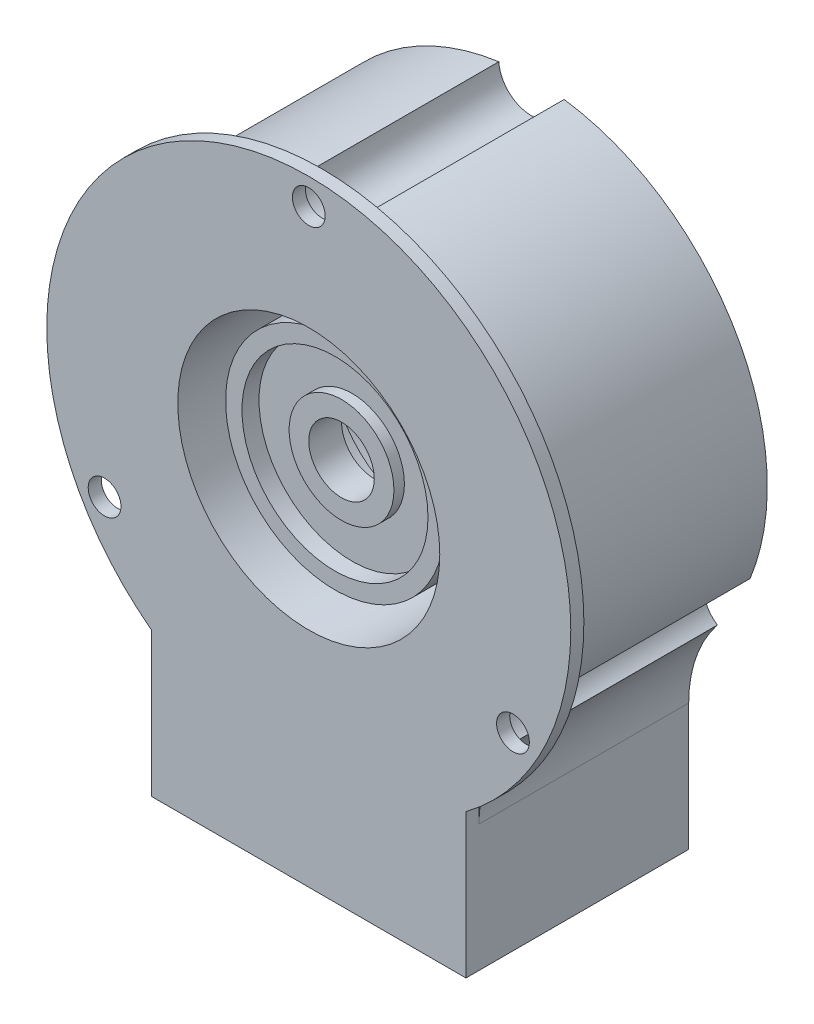
ISO-10303-21;
HEADER;
FILE_DESCRIPTION(('STEP AP214'),'2;1');
FILE_NAME('part.step','',(''),(''),'','','');
FILE_SCHEMA(('AUTOMOTIVE_DESIGN { 1 0 10303 214 1 1 1 1 }'));
ENDSEC;
DATA;
#1=APPLICATION_CONTEXT('core data for automotive mechanical design processes');
#2=APPLICATION_PROTOCOL_DEFINITION('international standard','automotive_design',2000,#1);
#3=PRODUCT_CONTEXT('',#1,'mechanical');
#4=PRODUCT('Part','Part','',(#3));
#5=PRODUCT_RELATED_PRODUCT_CATEGORY('part','',(#4));
#6=PRODUCT_DEFINITION_FORMATION('','',#4);
#7=PRODUCT_DEFINITION_CONTEXT('part definition',#1,'design');
#8=PRODUCT_DEFINITION('design','',#6,#7);
#9=PRODUCT_DEFINITION_SHAPE('','',#8);
#10=(LENGTH_UNIT() NAMED_UNIT(*) SI_UNIT(.MILLI.,.METRE.));
#11=(NAMED_UNIT(*) PLANE_ANGLE_UNIT() SI_UNIT($,.RADIAN.));
#12=(NAMED_UNIT(*) SI_UNIT($,.STERADIAN.) SOLID_ANGLE_UNIT());
#13=UNCERTAINTY_MEASURE_WITH_UNIT(LENGTH_MEASURE(1.E-05),#10,'distance_accuracy_value','');
#14=(GEOMETRIC_REPRESENTATION_CONTEXT(3) GLOBAL_UNCERTAINTY_ASSIGNED_CONTEXT((#13)) GLOBAL_UNIT_ASSIGNED_CONTEXT((#10,
#11,#12)) REPRESENTATION_CONTEXT('',''));
#15=CARTESIAN_POINT('',(0.,0.,0.));
#16=DIRECTION('',(0.,0.,1.));
#17=DIRECTION('',(1.,0.,0.));
#18=AXIS2_PLACEMENT_3D('',#15,#16,#17);
#19=CARTESIAN_POINT('',(0.,27.,16.));
#20=DIRECTION('',(0.,0.,1.));
#21=DIRECTION('',(1.,0.,0.));
#22=AXIS2_PLACEMENT_3D('',#19,#20,#21);
#23=CYLINDRICAL_SURFACE('',#22,7.35);
#24=CARTESIAN_POINT('',(0.,27.,8.));
#25=DIRECTION('',(0.,0.,1.));
#26=DIRECTION('',(1.,0.,0.));
#27=AXIS2_PLACEMENT_3D('',#24,#25,#26);
#28=CIRCLE('',#27,7.35);
#29=CARTESIAN_POINT('',(7.35,27.,8.));
#30=VERTEX_POINT('',#29);
#31=EDGE_CURVE('E11',#30,#30,#28,.T.);
#32=ORIENTED_EDGE('',*,*,#31,.F.);
#33=EDGE_LOOP('',(#32));
#34=FACE_BOUND('',#33,.T.);
#35=CARTESIAN_POINT('',(0.,27.,12.));
#36=DIRECTION('',(0.,0.,1.));
#37=DIRECTION('',(1.,0.,0.));
#38=AXIS2_PLACEMENT_3D('',#35,#36,#37);
#39=CIRCLE('',#38,7.35000000000001);
#40=CARTESIAN_POINT('',(7.35000000000001,27.,12.));
#41=VERTEX_POINT('',#40);
#42=EDGE_CURVE('E91',#41,#41,#39,.T.);
#43=ORIENTED_EDGE('',*,*,#42,.T.);
#44=EDGE_LOOP('',(#43));
#45=FACE_BOUND('',#44,.T.);
#46=ADVANCED_FACE('F51',(#34,#45),#23,.F.);
#47=CARTESIAN_POINT('',(0.,34.35,8.));
#48=DIRECTION('',(0.,0.,1.));
#49=DIRECTION('',(1.,0.,0.));
#50=AXIS2_PLACEMENT_3D('',#47,#48,#49);
#51=PLANE('',#50);
#52=CARTESIAN_POINT('',(0.,27.,8.));
#53=DIRECTION('',(0.,0.,1.));
#54=DIRECTION('',(1.,0.,0.));
#55=AXIS2_PLACEMENT_3D('',#52,#53,#54);
#56=CIRCLE('',#55,8.35);
#57=CARTESIAN_POINT('',(8.35,27.,8.));
#58=VERTEX_POINT('',#57);
#59=EDGE_CURVE('E57',#58,#58,#56,.T.);
#60=ORIENTED_EDGE('',*,*,#59,.F.);
#61=EDGE_LOOP('',(#60));
#62=FACE_BOUND('',#61,.T.);
#63=ORIENTED_EDGE('',*,*,#31,.T.);
#64=EDGE_LOOP('',(#63));
#65=FACE_BOUND('',#64,.T.);
#66=ADVANCED_FACE('F141',(#62,#65),#51,.F.);
#67=CARTESIAN_POINT('',(0.,27.,16.));
#68=DIRECTION('',(0.,0.,1.));
#69=DIRECTION('',(1.,0.,0.));
#70=AXIS2_PLACEMENT_3D('',#67,#68,#69);
#71=CYLINDRICAL_SURFACE('',#70,8.35);
#72=CARTESIAN_POINT('',(0.,27.,15.));
#73=DIRECTION('',(0.,0.,1.));
#74=DIRECTION('',(1.,0.,0.));
#75=AXIS2_PLACEMENT_3D('',#72,#73,#74);
#76=CIRCLE('',#75,8.35);
#77=CARTESIAN_POINT('',(8.35,27.,15.));
#78=VERTEX_POINT('',#77);
#79=EDGE_CURVE('E61',#78,#78,#76,.T.);
#80=ORIENTED_EDGE('',*,*,#79,.F.);
#81=EDGE_LOOP('',(#80));
#82=FACE_BOUND('',#81,.T.);
#83=ORIENTED_EDGE('',*,*,#59,.T.);
#84=EDGE_LOOP('',(#83));
#85=FACE_BOUND('',#84,.T.);
#86=ADVANCED_FACE('F136',(#82,#85),#71,.T.);
#87=CARTESIAN_POINT('',(0.,35.35,15.));
#88=DIRECTION('',(0.,0.,-1.));
#89=DIRECTION('',(-1.,0.,0.));
#90=AXIS2_PLACEMENT_3D('',#87,#88,#89);
#91=PLANE('',#90);
#92=CARTESIAN_POINT('',(0.,27.,15.));
#93=DIRECTION('',(0.,0.,1.));
#94=DIRECTION('',(1.,0.,0.));
#95=AXIS2_PLACEMENT_3D('',#92,#93,#94);
#96=CIRCLE('',#95,7.1);
#97=CARTESIAN_POINT('',(7.1,27.,15.));
#98=VERTEX_POINT('',#97);
#99=EDGE_CURVE('E66',#98,#98,#96,.T.);
#100=ORIENTED_EDGE('',*,*,#99,.F.);
#101=EDGE_LOOP('',(#100));
#102=FACE_BOUND('',#101,.T.);
#103=ORIENTED_EDGE('',*,*,#79,.T.);
#104=EDGE_LOOP('',(#103));
#105=FACE_BOUND('',#104,.T.);
#106=ADVANCED_FACE('F130',(#102,#105),#91,.F.);
#107=CARTESIAN_POINT('',(0.,27.,16.));
#108=DIRECTION('',(0.,0.,1.));
#109=DIRECTION('',(1.,0.,0.));
#110=AXIS2_PLACEMENT_3D('',#107,#108,#109);
#111=CYLINDRICAL_SURFACE('',#110,7.1);
#112=CARTESIAN_POINT('',(0.,27.,13.7));
#113=DIRECTION('',(0.,0.,1.));
#114=DIRECTION('',(1.,0.,0.));
#115=AXIS2_PLACEMENT_3D('',#112,#113,#114);
#116=CIRCLE('',#115,7.1);
#117=CARTESIAN_POINT('',(7.1,27.,13.7));
#118=VERTEX_POINT('',#117);
#119=EDGE_CURVE('E72',#118,#118,#116,.T.);
#120=ORIENTED_EDGE('',*,*,#119,.F.);
#121=EDGE_LOOP('',(#120));
#122=FACE_BOUND('',#121,.T.);
#123=ORIENTED_EDGE('',*,*,#99,.T.);
#124=EDGE_LOOP('',(#123));
#125=FACE_BOUND('',#124,.T.);
#126=ADVANCED_FACE('F124',(#122,#125),#111,.F.);
#127=CARTESIAN_POINT('',(0.,34.1,13.7));
#128=DIRECTION('',(0.,0.,-1.));
#129=DIRECTION('',(-1.,0.,0.));
#130=AXIS2_PLACEMENT_3D('',#127,#128,#129);
#131=PLANE('',#130);
#132=CARTESIAN_POINT('',(0.,27.,13.7));
#133=DIRECTION('',(0.,0.,1.));
#134=DIRECTION('',(1.,0.,0.));
#135=AXIS2_PLACEMENT_3D('',#132,#133,#134);
#136=CIRCLE('',#135,4.);
#137=CARTESIAN_POINT('',(4.,27.,13.7));
#138=VERTEX_POINT('',#137);
#139=EDGE_CURVE('E76',#138,#138,#136,.T.);
#140=ORIENTED_EDGE('',*,*,#139,.F.);
#141=EDGE_LOOP('',(#140));
#142=FACE_BOUND('',#141,.T.);
#143=ORIENTED_EDGE('',*,*,#119,.T.);
#144=EDGE_LOOP('',(#143));
#145=FACE_BOUND('',#144,.T.);
#146=ADVANCED_FACE('F118',(#142,#145),#131,.F.);
#147=CARTESIAN_POINT('',(0.,27.,16.));
#148=DIRECTION('',(0.,0.,1.));
#149=DIRECTION('',(1.,0.,0.));
#150=AXIS2_PLACEMENT_3D('',#147,#148,#149);
#151=CYLINDRICAL_SURFACE('',#150,4.);
#152=CARTESIAN_POINT('',(0.,27.,14.5));
#153=DIRECTION('',(0.,0.,1.));
#154=DIRECTION('',(1.,0.,0.));
#155=AXIS2_PLACEMENT_3D('',#152,#153,#154);
#156=CIRCLE('',#155,4.);
#157=CARTESIAN_POINT('',(4.,27.,14.5));
#158=VERTEX_POINT('',#157);
#159=EDGE_CURVE('E80',#158,#158,#156,.T.);
#160=ORIENTED_EDGE('',*,*,#159,.F.);
#161=EDGE_LOOP('',(#160));
#162=FACE_BOUND('',#161,.T.);
#163=ORIENTED_EDGE('',*,*,#139,.T.);
#164=EDGE_LOOP('',(#163));
#165=FACE_BOUND('',#164,.T.);
#166=ADVANCED_FACE('F112',(#162,#165),#151,.T.);
#167=CARTESIAN_POINT('',(0.,31.,14.5));
#168=DIRECTION('',(0.,0.,-1.));
#169=DIRECTION('',(-1.,0.,0.));
#170=AXIS2_PLACEMENT_3D('',#167,#168,#169);
#171=PLANE('',#170);
#172=CARTESIAN_POINT('',(0.,27.,14.5));
#173=DIRECTION('',(0.,0.,1.));
#174=DIRECTION('',(1.,0.,0.));
#175=AXIS2_PLACEMENT_3D('',#172,#173,#174);
#176=CIRCLE('',#175,2.5);
#177=CARTESIAN_POINT('',(2.5,27.,14.5));
#178=VERTEX_POINT('',#177);
#179=EDGE_CURVE('E84',#178,#178,#176,.T.);
#180=ORIENTED_EDGE('',*,*,#179,.F.);
#181=EDGE_LOOP('',(#180));
#182=FACE_BOUND('',#181,.T.);
#183=ORIENTED_EDGE('',*,*,#159,.T.);
#184=EDGE_LOOP('',(#183));
#185=FACE_BOUND('',#184,.T.);
#186=ADVANCED_FACE('F106',(#182,#185),#171,.F.);
#187=CARTESIAN_POINT('',(0.,27.,16.));
#188=DIRECTION('',(0.,0.,1.));
#189=DIRECTION('',(1.,0.,0.));
#190=AXIS2_PLACEMENT_3D('',#187,#188,#189);
#191=CYLINDRICAL_SURFACE('',#190,2.5);
#192=CARTESIAN_POINT('',(0.,27.,12.));
#193=DIRECTION('',(0.,0.,1.));
#194=DIRECTION('',(1.,0.,0.));
#195=AXIS2_PLACEMENT_3D('',#192,#193,#194);
#196=CIRCLE('',#195,2.5);
#197=CARTESIAN_POINT('',(2.5,27.,12.));
#198=VERTEX_POINT('',#197);
#199=EDGE_CURVE('E88',#198,#198,#196,.T.);
#200=ORIENTED_EDGE('',*,*,#199,.F.);
#201=EDGE_LOOP('',(#200));
#202=FACE_BOUND('',#201,.T.);
#203=ORIENTED_EDGE('',*,*,#179,.T.);
#204=EDGE_LOOP('',(#203));
#205=FACE_BOUND('',#204,.T.);
#206=ADVANCED_FACE('F100',(#202,#205),#191,.F.);
#207=CARTESIAN_POINT('',(0.,29.5,12.));
#208=DIRECTION('',(0.,0.,1.));
#209=DIRECTION('',(1.,0.,0.));
#210=AXIS2_PLACEMENT_3D('',#207,#208,#209);
#211=PLANE('',#210);
#212=ORIENTED_EDGE('',*,*,#42,.F.);
#213=EDGE_LOOP('',(#212));
#214=FACE_BOUND('',#213,.T.);
#215=ORIENTED_EDGE('',*,*,#199,.T.);
#216=EDGE_LOOP('',(#215));
#217=FACE_BOUND('',#216,.T.);
#218=ADVANCED_FACE('F97',(#214,#217),#211,.F.);
#219=CLOSED_SHELL('',(#46,#66,#86,#106,#126,#146,#166,#186,#206,#218));
#220=MANIFOLD_SOLID_BREP('B2',#219);
#221=CARTESIAN_POINT('',(0.,27.,16.));
#222=DIRECTION('',(0.,0.,-1.));
#223=DIRECTION('',(-1.,0.,0.));
#224=AXIS2_PLACEMENT_3D('',#221,#222,#223);
#225=CYLINDRICAL_SURFACE('',#224,18.);
#226=CARTESIAN_POINT('',(0.,27.,0.));
#227=DIRECTION('',(0.,0.,1.));
#228=DIRECTION('',(-1.,0.,0.));
#229=AXIS2_PLACEMENT_3D('',#226,#227,#228);
#230=CIRCLE('',#229,18.);
#231=CARTESIAN_POINT('',(16.6850879110635,20.2466422129372,0.));
#232=VERTEX_POINT('',#231);
#233=CARTESIAN_POINT('',(2.49396455109104,44.8263888888889,0.));
#234=VERTEX_POINT('',#233);
#235=EDGE_CURVE('E345',#232,#234,#230,.T.);
#236=ORIENTED_EDGE('',*,*,#235,.T.);
#237=DIRECTION('',(0.,0.,-1.));
#238=VECTOR('',#237,1.);
#239=CARTESIAN_POINT('',(2.49396455109104,44.8263888888889,8.));
#240=LINE('',#239,#238);
#241=CARTESIAN_POINT('',(2.49396455109104,44.8263888888889,16.));
#242=VERTEX_POINT('',#241);
#243=EDGE_CURVE('E329',#234,#242,#240,.F.);
#244=ORIENTED_EDGE('',*,*,#243,.T.);
#245=CARTESIAN_POINT('',(0.,27.,16.));
#246=DIRECTION('',(0.,0.,1.));
#247=DIRECTION('',(-1.,0.,0.));
#248=AXIS2_PLACEMENT_3D('',#245,#246,#247);
#249=CIRCLE('',#248,18.);
#250=CARTESIAN_POINT('',(16.6850879110635,20.2466422129372,16.));
#251=VERTEX_POINT('',#250);
#252=EDGE_CURVE('E343',#251,#242,#249,.T.);
#253=ORIENTED_EDGE('',*,*,#252,.F.);
#254=DIRECTION('',(0.,0.,-1.));
#255=VECTOR('',#254,1.);
#256=CARTESIAN_POINT('',(16.6850879110635,20.2466422129372,8.));
#257=LINE('',#256,#255);
#258=EDGE_CURVE('E474',#251,#232,#257,.T.);
#259=ORIENTED_EDGE('',*,*,#258,.T.);
#260=EDGE_LOOP('',(#236,#244,#253,#259));
#261=FACE_BOUND('',#260,.T.);
#262=ADVANCED_FACE('F210',(#261),#225,.T.);
#263=CARTESIAN_POINT('',(0.,27.,17.));
#264=DIRECTION('',(0.,0.,1.));
#265=DIRECTION('',(1.,0.,0.));
#266=AXIS2_PLACEMENT_3D('',#263,#264,#265);
#267=PLANE('',#266);
#268=CARTESIAN_POINT('',(0.,27.,17.));
#269=DIRECTION('',(0.,0.,1.));
#270=DIRECTION('',(1.,0.,0.));
#271=AXIS2_PLACEMENT_3D('',#268,#269,#270);
#272=CIRCLE('',#271,10.);
#273=CARTESIAN_POINT('',(10.,27.,17.));
#274=VERTEX_POINT('',#273);
#275=EDGE_CURVE('E515',#274,#274,#272,.T.);
#276=ORIENTED_EDGE('',*,*,#275,.F.);
#277=EDGE_LOOP('',(#276));
#278=FACE_BOUND('',#277,.T.);
#279=CARTESIAN_POINT('',(15.5884572681186,17.9999999999994,17.));
#280=DIRECTION('',(0.,0.,-1.));
#281=DIRECTION('',(-1.,0.,0.));
#282=AXIS2_PLACEMENT_3D('',#279,#280,#281);
#283=CIRCLE('',#282,1.24999999999999);
#284=CARTESIAN_POINT('',(14.3384572681187,17.9999999999994,17.));
#285=VERTEX_POINT('',#284);
#286=EDGE_CURVE('E485',#285,#285,#283,.T.);
#287=ORIENTED_EDGE('',*,*,#286,.T.);
#288=EDGE_LOOP('',(#287));
#289=FACE_BOUND('',#288,.T.);
#290=DIRECTION('',(1.,0.,0.));
#291=VECTOR('',#290,1.);
#292=CARTESIAN_POINT('',(12.,0.,17.));
#293=LINE('',#292,#291);
#294=CARTESIAN_POINT('',(-12.,0.,17.));
#295=VERTEX_POINT('',#294);
#296=CARTESIAN_POINT('',(12.,0.,17.));
#297=VERTEX_POINT('',#296);
#298=EDGE_CURVE('E388',#295,#297,#293,.T.);
#299=ORIENTED_EDGE('',*,*,#298,.T.);
#300=DIRECTION('',(0.,1.,0.));
#301=VECTOR('',#300,1.);
#302=CARTESIAN_POINT('',(12.,11.,17.));
#303=LINE('',#302,#301);
#304=CARTESIAN_POINT('',(12.,11.,17.));
#305=VERTEX_POINT('',#304);
#306=EDGE_CURVE('E466',#297,#305,#303,.T.);
#307=ORIENTED_EDGE('',*,*,#306,.T.);
#308=CARTESIAN_POINT('',(0.,27.,17.));
#309=DIRECTION('',(0.,0.,1.));
#310=DIRECTION('',(1.,0.,0.));
#311=AXIS2_PLACEMENT_3D('',#308,#309,#310);
#312=CIRCLE('',#311,20.);
#313=CARTESIAN_POINT('',(-12.,11.,17.));
#314=VERTEX_POINT('',#313);
#315=EDGE_CURVE('E461',#305,#314,#312,.T.);
#316=ORIENTED_EDGE('',*,*,#315,.T.);
#317=DIRECTION('',(0.,-1.,0.));
#318=VECTOR('',#317,1.);
#319=CARTESIAN_POINT('',(-12.,0.,17.));
#320=LINE('',#319,#318);
#321=EDGE_CURVE('E458',#314,#295,#320,.T.);
#322=ORIENTED_EDGE('',*,*,#321,.T.);
#323=EDGE_LOOP('',(#299,#307,#316,#322));
#324=FACE_BOUND('',#323,.T.);
#325=CARTESIAN_POINT('',(-15.5884572681212,18.0000000000007,17.));
#326=DIRECTION('',(0.,0.,-1.));
#327=DIRECTION('',(-1.,0.,0.));
#328=AXIS2_PLACEMENT_3D('',#325,#326,#327);
#329=CIRCLE('',#328,1.25);
#330=CARTESIAN_POINT('',(-16.8384572681212,18.0000000000007,17.));
#331=VERTEX_POINT('',#330);
#332=EDGE_CURVE('E346',#331,#331,#329,.T.);
#333=ORIENTED_EDGE('',*,*,#332,.T.);
#334=EDGE_LOOP('',(#333));
#335=FACE_BOUND('',#334,.T.);
#336=CARTESIAN_POINT('',(0.,45.,17.));
#337=DIRECTION('',(0.,0.,-1.));
#338=DIRECTION('',(-1.,0.,0.));
#339=AXIS2_PLACEMENT_3D('',#336,#337,#338);
#340=CIRCLE('',#339,1.25);
#341=CARTESIAN_POINT('',(-1.25,45.,17.));
#342=VERTEX_POINT('',#341);
#343=EDGE_CURVE('E337',#342,#342,#340,.T.);
#344=ORIENTED_EDGE('',*,*,#343,.T.);
#345=EDGE_LOOP('',(#344));
#346=FACE_BOUND('',#345,.T.);
#347=ADVANCED_FACE('F522',(#278,#289,#324,#335,#346),#267,.T.);
#348=CARTESIAN_POINT('',(0.,27.,16.));
#349=DIRECTION('',(0.,0.,1.));
#350=DIRECTION('',(1.,0.,0.));
#351=AXIS2_PLACEMENT_3D('',#348,#349,#350);
#352=PLANE('',#351);
#353=CARTESIAN_POINT('',(0.,45.,16.));
#354=DIRECTION('',(0.,0.,-1.));
#355=DIRECTION('',(-1.,0.,0.));
#356=AXIS2_PLACEMENT_3D('',#353,#354,#355);
#357=CIRCLE('',#356,1.25);
#358=CARTESIAN_POINT('',(-1.25,45.,16.));
#359=VERTEX_POINT('',#358);
#360=EDGE_CURVE('E49',#359,#359,#357,.T.);
#361=ORIENTED_EDGE('',*,*,#360,.F.);
#362=EDGE_LOOP('',(#361));
#363=FACE_BOUND('',#362,.T.);
#364=CARTESIAN_POINT('',(-15.5884572681212,18.0000000000007,16.));
#365=DIRECTION('',(0.,0.,-1.));
#366=DIRECTION('',(-1.,0.,0.));
#367=AXIS2_PLACEMENT_3D('',#364,#365,#366);
#368=CIRCLE('',#367,1.25);
#369=CARTESIAN_POINT('',(-16.8384572681212,18.0000000000007,16.));
#370=VERTEX_POINT('',#369);
#371=EDGE_CURVE('E219',#370,#370,#368,.T.);
#372=ORIENTED_EDGE('',*,*,#371,.F.);
#373=EDGE_LOOP('',(#372));
#374=FACE_BOUND('',#373,.T.);
#375=CARTESIAN_POINT('',(-22.,9.67949192431122,16.));
#376=DIRECTION('',(0.,0.,-1.));
#377=DIRECTION('',(1.,0.,0.));
#378=AXIS2_PLACEMENT_3D('',#375,#376,#377);
#379=CIRCLE('',#378,10.);
#380=CARTESIAN_POINT('',(-14.1428571428571,15.8653876656286,16.));
#381=VERTEX_POINT('',#380);
#382=CARTESIAN_POINT('',(-12.0976707116955,11.0737209822449,16.));
#383=VERTEX_POINT('',#382);
#384=EDGE_CURVE('E440',#381,#383,#379,.T.);
#385=ORIENTED_EDGE('',*,*,#384,.T.);
#386=CARTESIAN_POINT('',(0.,27.,16.));
#387=DIRECTION('',(0.,0.,1.));
#388=DIRECTION('',(1.,0.,0.));
#389=AXIS2_PLACEMENT_3D('',#386,#387,#388);
#390=CIRCLE('',#389,20.);
#391=CARTESIAN_POINT('',(12.0976707116955,11.0737209822449,16.));
#392=VERTEX_POINT('',#391);
#393=EDGE_CURVE('E234',#392,#383,#390,.T.);
#394=ORIENTED_EDGE('',*,*,#393,.F.);
#395=CARTESIAN_POINT('',(22.,9.67949192431122,16.));
#396=DIRECTION('',(0.,0.,-1.));
#397=DIRECTION('',(-1.,0.,0.));
#398=AXIS2_PLACEMENT_3D('',#395,#396,#397);
#399=CIRCLE('',#398,10.);
#400=CARTESIAN_POINT('',(14.1428571428571,15.8653876656286,16.));
#401=VERTEX_POINT('',#400);
#402=EDGE_CURVE('E373',#392,#401,#399,.T.);
#403=ORIENTED_EDGE('',*,*,#402,.T.);
#404=CARTESIAN_POINT('',(14.1911233599722,15.9269688981719,16.));
#405=VERTEX_POINT('',#404);
#406=EDGE_CURVE('E355',#401,#405,#249,.T.);
#407=ORIENTED_EDGE('',*,*,#406,.T.);
#408=CARTESIAN_POINT('',(15.5884572681186,17.9999999999994,16.));
#409=DIRECTION('',(0.,0.,-1.));
#410=DIRECTION('',(-1.,0.,0.));
#411=AXIS2_PLACEMENT_3D('',#408,#409,#410);
#412=CIRCLE('',#411,2.5);
#413=EDGE_CURVE('E353',#405,#251,#412,.T.);
#414=ORIENTED_EDGE('',*,*,#413,.T.);
#415=ORIENTED_EDGE('',*,*,#252,.T.);
#416=CARTESIAN_POINT('',(0.,45.,16.));
#417=DIRECTION('',(0.,0.,-1.));
#418=DIRECTION('',(-1.,0.,0.));
#419=AXIS2_PLACEMENT_3D('',#416,#417,#418);
#420=CIRCLE('',#419,2.5);
#421=CARTESIAN_POINT('',(-2.49396455109104,44.8263888888889,16.));
#422=VERTEX_POINT('',#421);
#423=EDGE_CURVE('E326',#242,#422,#420,.T.);
#424=ORIENTED_EDGE('',*,*,#423,.T.);
#425=CARTESIAN_POINT('',(-16.6850879110644,20.2466422129394,16.));
#426=VERTEX_POINT('',#425);
#427=EDGE_CURVE('E356',#422,#426,#249,.T.);
#428=ORIENTED_EDGE('',*,*,#427,.T.);
#429=CARTESIAN_POINT('',(-15.5884572681212,18.0000000000007,16.));
#430=DIRECTION('',(0.,0.,-1.));
#431=DIRECTION('',(-1.,0.,0.));
#432=AXIS2_PLACEMENT_3D('',#429,#430,#431);
#433=CIRCLE('',#432,2.5);
#434=CARTESIAN_POINT('',(-14.1911233599737,15.9269688981739,16.));
#435=VERTEX_POINT('',#434);
#436=EDGE_CURVE('E498',#426,#435,#433,.T.);
#437=ORIENTED_EDGE('',*,*,#436,.T.);
#438=EDGE_CURVE('E358',#435,#381,#249,.T.);
#439=ORIENTED_EDGE('',*,*,#438,.T.);
#440=EDGE_LOOP('',(#385,#394,#403,#407,#414,#415,#424,#428,#437,#439));
#441=FACE_BOUND('',#440,.T.);
#442=CARTESIAN_POINT('',(15.5884572681186,17.9999999999994,16.));
#443=DIRECTION('',(0.,0.,-1.));
#444=DIRECTION('',(-1.,0.,0.));
#445=AXIS2_PLACEMENT_3D('',#442,#443,#444);
#446=CIRCLE('',#445,1.25);
#447=CARTESIAN_POINT('',(14.3384572681186,17.9999999999994,16.));
#448=VERTEX_POINT('',#447);
#449=EDGE_CURVE('E482',#448,#448,#446,.T.);
#450=ORIENTED_EDGE('',*,*,#449,.F.);
#451=EDGE_LOOP('',(#450));
#452=FACE_BOUND('',#451,.T.);
#453=ADVANCED_FACE('F350',(#363,#374,#441,#452),#352,.F.);
#454=ORIENTED_EDGE('',*,*,#427,.F.);
#455=DIRECTION('',(0.,0.,-1.));
#456=VECTOR('',#455,1.);
#457=CARTESIAN_POINT('',(-2.49396455109104,44.8263888888889,8.));
#458=LINE('',#457,#456);
#459=CARTESIAN_POINT('',(-2.49396455109104,44.8263888888889,0.));
#460=VERTEX_POINT('',#459);
#461=EDGE_CURVE('E332',#422,#460,#458,.T.);
#462=ORIENTED_EDGE('',*,*,#461,.T.);
#463=CARTESIAN_POINT('',(-16.6850879110644,20.2466422129394,0.));
#464=VERTEX_POINT('',#463);
#465=EDGE_CURVE('E428',#460,#464,#230,.T.);
#466=ORIENTED_EDGE('',*,*,#465,.T.);
#467=DIRECTION('',(0.,0.,-1.));
#468=VECTOR('',#467,1.);
#469=CARTESIAN_POINT('',(-16.6850879110644,20.2466422129394,8.));
#470=LINE('',#469,#468);
#471=EDGE_CURVE('E489',#464,#426,#470,.F.);
#472=ORIENTED_EDGE('',*,*,#471,.T.);
#473=EDGE_LOOP('',(#454,#462,#466,#472));
#474=FACE_BOUND('',#473,.T.);
#475=ADVANCED_FACE('F542',(#474),#225,.T.);
#476=CARTESIAN_POINT('',(14.1428571428571,15.8653876656286,0.));
#477=VERTEX_POINT('',#476);
#478=CARTESIAN_POINT('',(14.1911233599722,15.9269688981719,0.));
#479=VERTEX_POINT('',#478);
#480=EDGE_CURVE('E426',#477,#479,#230,.T.);
#481=ORIENTED_EDGE('',*,*,#480,.T.);
#482=DIRECTION('',(0.,0.,-1.));
#483=VECTOR('',#482,1.);
#484=CARTESIAN_POINT('',(14.1911233599722,15.9269688981719,8.));
#485=LINE('',#484,#483);
#486=EDGE_CURVE('E471',#479,#405,#485,.F.);
#487=ORIENTED_EDGE('',*,*,#486,.T.);
#488=ORIENTED_EDGE('',*,*,#406,.F.);
#489=DIRECTION('',(0.,0.,-1.));
#490=VECTOR('',#489,1.);
#491=CARTESIAN_POINT('',(14.1428571428571,15.8653876656286,16.));
#492=LINE('',#491,#490);
#493=EDGE_CURVE('E405',#401,#477,#492,.T.);
#494=ORIENTED_EDGE('',*,*,#493,.T.);
#495=EDGE_LOOP('',(#481,#487,#488,#494));
#496=FACE_BOUND('',#495,.T.);
#497=ADVANCED_FACE('F567',(#496),#225,.T.);
#498=CARTESIAN_POINT('',(-22.,9.67949192431122,0.));
#499=DIRECTION('',(0.,0.,1.));
#500=DIRECTION('',(1.,0.,0.));
#501=AXIS2_PLACEMENT_3D('',#498,#499,#500);
#502=PLANE('',#501);
#503=ORIENTED_EDGE('',*,*,#465,.F.);
#504=CARTESIAN_POINT('',(0.,45.,0.));
#505=DIRECTION('',(0.,0.,-1.));
#506=DIRECTION('',(-1.,0.,0.));
#507=AXIS2_PLACEMENT_3D('',#504,#505,#506);
#508=CIRCLE('',#507,2.5);
#509=EDGE_CURVE('E336',#234,#460,#508,.T.);
#510=ORIENTED_EDGE('',*,*,#509,.F.);
#511=ORIENTED_EDGE('',*,*,#235,.F.);
#512=CARTESIAN_POINT('',(15.5884572681186,17.9999999999994,0.));
#513=DIRECTION('',(0.,0.,-1.));
#514=DIRECTION('',(-1.,0.,0.));
#515=AXIS2_PLACEMENT_3D('',#512,#513,#514);
#516=CIRCLE('',#515,2.5);
#517=EDGE_CURVE('E477',#479,#232,#516,.T.);
#518=ORIENTED_EDGE('',*,*,#517,.F.);
#519=ORIENTED_EDGE('',*,*,#480,.F.);
#520=CARTESIAN_POINT('',(22.,9.67949192431122,0.));
#521=DIRECTION('',(0.,0.,-1.));
#522=DIRECTION('',(-1.,0.,0.));
#523=AXIS2_PLACEMENT_3D('',#520,#521,#522);
#524=CIRCLE('',#523,10.);
#525=CARTESIAN_POINT('',(12.,9.67949192431122,0.));
#526=VERTEX_POINT('',#525);
#527=EDGE_CURVE('E429',#526,#477,#524,.T.);
#528=ORIENTED_EDGE('',*,*,#527,.F.);
#529=DIRECTION('',(0.,1.,0.));
#530=VECTOR('',#529,1.);
#531=CARTESIAN_POINT('',(12.,0.,0.));
#532=LINE('',#531,#530);
#533=CARTESIAN_POINT('',(12.,0.,0.));
#534=VERTEX_POINT('',#533);
#535=EDGE_CURVE('E432',#534,#526,#532,.T.);
#536=ORIENTED_EDGE('',*,*,#535,.F.);
#537=DIRECTION('',(1.,0.,0.));
#538=VECTOR('',#537,1.);
#539=CARTESIAN_POINT('',(-12.,0.,0.));
#540=LINE('',#539,#538);
#541=CARTESIAN_POINT('',(-12.,0.,0.));
#542=VERTEX_POINT('',#541);
#543=EDGE_CURVE('E435',#542,#534,#540,.T.);
#544=ORIENTED_EDGE('',*,*,#543,.F.);
#545=DIRECTION('',(0.,-1.,0.));
#546=VECTOR('',#545,1.);
#547=CARTESIAN_POINT('',(-12.,0.,0.));
#548=LINE('',#547,#546);
#549=CARTESIAN_POINT('',(-12.,9.67949192431122,0.));
#550=VERTEX_POINT('',#549);
#551=EDGE_CURVE('E438',#550,#542,#548,.T.);
#552=ORIENTED_EDGE('',*,*,#551,.F.);
#553=CARTESIAN_POINT('',(-22.,9.67949192431122,0.));
#554=DIRECTION('',(0.,0.,-1.));
#555=DIRECTION('',(1.,0.,0.));
#556=AXIS2_PLACEMENT_3D('',#553,#554,#555);
#557=CIRCLE('',#556,10.);
#558=CARTESIAN_POINT('',(-14.1428571428571,15.8653876656286,0.));
#559=VERTEX_POINT('',#558);
#560=EDGE_CURVE('E379',#559,#550,#557,.T.);
#561=ORIENTED_EDGE('',*,*,#560,.F.);
#562=CARTESIAN_POINT('',(-14.1911233599737,15.9269688981739,0.));
#563=VERTEX_POINT('',#562);
#564=EDGE_CURVE('E431',#563,#559,#230,.T.);
#565=ORIENTED_EDGE('',*,*,#564,.F.);
#566=CARTESIAN_POINT('',(-15.5884572681212,18.0000000000007,0.));
#567=DIRECTION('',(0.,0.,-1.));
#568=DIRECTION('',(-1.,0.,0.));
#569=AXIS2_PLACEMENT_3D('',#566,#567,#568);
#570=CIRCLE('',#569,2.5);
#571=EDGE_CURVE('E496',#464,#563,#570,.T.);
#572=ORIENTED_EDGE('',*,*,#571,.F.);
#573=EDGE_LOOP('',(#503,#510,#511,#518,#519,#528,#536,#544,#552,#561,#565,#572));
#574=FACE_BOUND('',#573,.T.);
#575=ADVANCED_FACE('F579',(#574),#502,.F.);
#576=CARTESIAN_POINT('',(-22.,9.67949192431122,16.));
#577=DIRECTION('',(0.,0.,1.));
#578=DIRECTION('',(1.,0.,0.));
#579=AXIS2_PLACEMENT_3D('',#576,#577,#578);
#580=PLANE('',#579);
#581=DIRECTION('',(0.,-1.,0.));
#582=VECTOR('',#581,1.);
#583=CARTESIAN_POINT('',(-12.,0.,16.));
#584=LINE('',#583,#582);
#585=CARTESIAN_POINT('',(-12.,11.,16.));
#586=VERTEX_POINT('',#585);
#587=CARTESIAN_POINT('',(-12.,9.67949192431122,16.));
#588=VERTEX_POINT('',#587);
#589=EDGE_CURVE('E227',#586,#588,#584,.T.);
#590=ORIENTED_EDGE('',*,*,#589,.F.);
#591=EDGE_CURVE('E401',#383,#586,#390,.T.);
#592=ORIENTED_EDGE('',*,*,#591,.F.);
#593=EDGE_CURVE('E362',#383,#588,#379,.T.);
#594=ORIENTED_EDGE('',*,*,#593,.T.);
#595=EDGE_LOOP('',(#590,#592,#594));
#596=FACE_BOUND('',#595,.T.);
#597=ADVANCED_FACE('F447',(#596),#580,.T.);
#598=CARTESIAN_POINT('',(-12.,0.,16.));
#599=DIRECTION('',(1.,0.,0.));
#600=DIRECTION('',(0.,1.,0.));
#601=AXIS2_PLACEMENT_3D('',#598,#599,#600);
#602=PLANE('',#601);
#603=ORIENTED_EDGE('',*,*,#551,.T.);
#604=DIRECTION('',(0.,0.,-1.));
#605=VECTOR('',#604,1.);
#606=CARTESIAN_POINT('',(-12.,0.,16.));
#607=LINE('',#606,#605);
#608=EDGE_CURVE('E395',#295,#542,#607,.T.);
#609=ORIENTED_EDGE('',*,*,#608,.F.);
#610=ORIENTED_EDGE('',*,*,#321,.F.);
#611=DIRECTION('',(0.,0.,-1.));
#612=VECTOR('',#611,1.);
#613=CARTESIAN_POINT('',(-12.,11.,17.));
#614=LINE('',#613,#612);
#615=EDGE_CURVE('E456',#314,#586,#614,.T.);
#616=ORIENTED_EDGE('',*,*,#615,.T.);
#617=ORIENTED_EDGE('',*,*,#589,.T.);
#618=DIRECTION('',(0.,0.,-1.));
#619=VECTOR('',#618,1.);
#620=CARTESIAN_POINT('',(-12.,9.67949192431122,16.));
#621=LINE('',#620,#619);
#622=EDGE_CURVE('E422',#588,#550,#621,.T.);
#623=ORIENTED_EDGE('',*,*,#622,.T.);
#624=EDGE_LOOP('',(#603,#609,#610,#616,#617,#623));
#625=FACE_BOUND('',#624,.T.);
#626=ADVANCED_FACE('F212',(#625),#602,.F.);
#627=CARTESIAN_POINT('',(-12.,0.,16.));
#628=DIRECTION('',(0.,1.,0.));
#629=DIRECTION('',(0.,0.,1.));
#630=AXIS2_PLACEMENT_3D('',#627,#628,#629);
#631=PLANE('',#630);
#632=ORIENTED_EDGE('',*,*,#543,.T.);
#633=DIRECTION('',(0.,0.,-1.));
#634=VECTOR('',#633,1.);
#635=CARTESIAN_POINT('',(12.,0.,16.));
#636=LINE('',#635,#634);
#637=EDGE_CURVE('E404',#297,#534,#636,.T.);
#638=ORIENTED_EDGE('',*,*,#637,.F.);
#639=ORIENTED_EDGE('',*,*,#298,.F.);
#640=ORIENTED_EDGE('',*,*,#608,.T.);
#641=EDGE_LOOP('',(#632,#638,#639,#640));
#642=FACE_BOUND('',#641,.T.);
#643=ADVANCED_FACE('F608',(#642),#631,.F.);
#644=CARTESIAN_POINT('',(12.,0.,16.));
#645=DIRECTION('',(-1.,0.,0.));
#646=DIRECTION('',(0.,-1.,0.));
#647=AXIS2_PLACEMENT_3D('',#644,#645,#646);
#648=PLANE('',#647);
#649=ORIENTED_EDGE('',*,*,#535,.T.);
#650=DIRECTION('',(0.,0.,-1.));
#651=VECTOR('',#650,1.);
#652=CARTESIAN_POINT('',(12.,9.67949192431122,16.));
#653=LINE('',#652,#651);
#654=CARTESIAN_POINT('',(12.,9.67949192431122,16.));
#655=VERTEX_POINT('',#654);
#656=EDGE_CURVE('E402',#655,#526,#653,.T.);
#657=ORIENTED_EDGE('',*,*,#656,.F.);
#658=DIRECTION('',(0.,1.,0.));
#659=VECTOR('',#658,1.);
#660=CARTESIAN_POINT('',(12.,11.,16.));
#661=LINE('',#660,#659);
#662=CARTESIAN_POINT('',(12.,11.,16.));
#663=VERTEX_POINT('',#662);
#664=EDGE_CURVE('E399',#655,#663,#661,.T.);
#665=ORIENTED_EDGE('',*,*,#664,.T.);
#666=DIRECTION('',(0.,0.,-1.));
#667=VECTOR('',#666,1.);
#668=CARTESIAN_POINT('',(12.,11.,17.));
#669=LINE('',#668,#667);
#670=EDGE_CURVE('E390',#305,#663,#669,.T.);
#671=ORIENTED_EDGE('',*,*,#670,.F.);
#672=ORIENTED_EDGE('',*,*,#306,.F.);
#673=ORIENTED_EDGE('',*,*,#637,.T.);
#674=EDGE_LOOP('',(#649,#657,#665,#671,#672,#673));
#675=FACE_BOUND('',#674,.T.);
#676=ADVANCED_FACE('F577',(#675),#648,.F.);
#677=CARTESIAN_POINT('',(22.,9.67949192431122,16.));
#678=DIRECTION('',(0.,0.,-1.));
#679=DIRECTION('',(-1.,0.,0.));
#680=AXIS2_PLACEMENT_3D('',#677,#678,#679);
#681=CYLINDRICAL_SURFACE('',#680,10.);
#682=ORIENTED_EDGE('',*,*,#527,.T.);
#683=ORIENTED_EDGE('',*,*,#493,.F.);
#684=ORIENTED_EDGE('',*,*,#402,.F.);
#685=EDGE_CURVE('E367',#655,#392,#399,.T.);
#686=ORIENTED_EDGE('',*,*,#685,.F.);
#687=ORIENTED_EDGE('',*,*,#656,.T.);
#688=EDGE_LOOP('',(#682,#683,#684,#686,#687));
#689=FACE_BOUND('',#688,.T.);
#690=ADVANCED_FACE('F570',(#689),#681,.F.);
#691=ORIENTED_EDGE('',*,*,#438,.F.);
#692=DIRECTION('',(0.,0.,-1.));
#693=VECTOR('',#692,1.);
#694=CARTESIAN_POINT('',(-14.1911233599737,15.9269688981739,8.));
#695=LINE('',#694,#693);
#696=EDGE_CURVE('E493',#435,#563,#695,.T.);
#697=ORIENTED_EDGE('',*,*,#696,.T.);
#698=ORIENTED_EDGE('',*,*,#564,.T.);
#699=DIRECTION('',(0.,0.,-1.));
#700=VECTOR('',#699,1.);
#701=CARTESIAN_POINT('',(-14.1428571428571,15.8653876656286,16.));
#702=LINE('',#701,#700);
#703=EDGE_CURVE('E412',#381,#559,#702,.T.);
#704=ORIENTED_EDGE('',*,*,#703,.F.);
#705=EDGE_LOOP('',(#691,#697,#698,#704));
#706=FACE_BOUND('',#705,.T.);
#707=ADVANCED_FACE('F561',(#706),#225,.T.);
#708=CARTESIAN_POINT('',(-22.,9.67949192431122,16.));
#709=DIRECTION('',(0.,0.,-1.));
#710=DIRECTION('',(-1.,0.,0.));
#711=AXIS2_PLACEMENT_3D('',#708,#709,#710);
#712=CYLINDRICAL_SURFACE('',#711,10.);
#713=ORIENTED_EDGE('',*,*,#560,.T.);
#714=ORIENTED_EDGE('',*,*,#622,.F.);
#715=ORIENTED_EDGE('',*,*,#593,.F.);
#716=ORIENTED_EDGE('',*,*,#384,.F.);
#717=ORIENTED_EDGE('',*,*,#703,.T.);
#718=EDGE_LOOP('',(#713,#714,#715,#716,#717));
#719=FACE_BOUND('',#718,.T.);
#720=ADVANCED_FACE('F449',(#719),#712,.F.);
#721=EDGE_CURVE('E389',#663,#392,#390,.T.);
#722=ORIENTED_EDGE('',*,*,#721,.F.);
#723=ORIENTED_EDGE('',*,*,#664,.F.);
#724=ORIENTED_EDGE('',*,*,#685,.T.);
#725=EDGE_LOOP('',(#722,#723,#724));
#726=FACE_BOUND('',#725,.T.);
#727=ADVANCED_FACE('F576',(#726),#580,.T.);
#728=CARTESIAN_POINT('',(0.,27.,17.));
#729=DIRECTION('',(0.,0.,-1.));
#730=DIRECTION('',(-1.,0.,0.));
#731=AXIS2_PLACEMENT_3D('',#728,#729,#730);
#732=CYLINDRICAL_SURFACE('',#731,20.);
#733=ORIENTED_EDGE('',*,*,#721,.T.);
#734=ORIENTED_EDGE('',*,*,#393,.T.);
#735=ORIENTED_EDGE('',*,*,#591,.T.);
#736=ORIENTED_EDGE('',*,*,#615,.F.);
#737=ORIENTED_EDGE('',*,*,#315,.F.);
#738=ORIENTED_EDGE('',*,*,#670,.T.);
#739=EDGE_LOOP('',(#733,#734,#735,#736,#737,#738));
#740=FACE_BOUND('',#739,.T.);
#741=ADVANCED_FACE('F591',(#740),#732,.T.);
#742=CARTESIAN_POINT('',(15.5884572681186,17.9999999999994,0.));
#743=DIRECTION('',(0.,0.,-1.));
#744=DIRECTION('',(-1.,0.,0.));
#745=AXIS2_PLACEMENT_3D('',#742,#743,#744);
#746=CYLINDRICAL_SURFACE('',#745,2.5);
#747=ORIENTED_EDGE('',*,*,#517,.T.);
#748=ORIENTED_EDGE('',*,*,#258,.F.);
#749=ORIENTED_EDGE('',*,*,#413,.F.);
#750=ORIENTED_EDGE('',*,*,#486,.F.);
#751=EDGE_LOOP('',(#747,#748,#749,#750));
#752=FACE_BOUND('',#751,.T.);
#753=ADVANCED_FACE('F589',(#752),#746,.F.);
#754=CARTESIAN_POINT('',(15.5884572681186,17.9999999999994,0.));
#755=DIRECTION('',(0.,0.,-1.));
#756=DIRECTION('',(-1.,0.,0.));
#757=AXIS2_PLACEMENT_3D('',#754,#755,#756);
#758=CYLINDRICAL_SURFACE('',#757,1.25);
#759=ORIENTED_EDGE('',*,*,#286,.F.);
#760=EDGE_LOOP('',(#759));
#761=FACE_BOUND('',#760,.T.);
#762=ORIENTED_EDGE('',*,*,#449,.T.);
#763=EDGE_LOOP('',(#762));
#764=FACE_BOUND('',#763,.T.);
#765=ADVANCED_FACE('F556',(#761,#764),#758,.F.);
#766=CARTESIAN_POINT('',(-15.5884572681212,18.0000000000007,0.));
#767=DIRECTION('',(0.,0.,-1.));
#768=DIRECTION('',(-1.,0.,0.));
#769=AXIS2_PLACEMENT_3D('',#766,#767,#768);
#770=CYLINDRICAL_SURFACE('',#769,2.5);
#771=ORIENTED_EDGE('',*,*,#571,.T.);
#772=ORIENTED_EDGE('',*,*,#696,.F.);
#773=ORIENTED_EDGE('',*,*,#436,.F.);
#774=ORIENTED_EDGE('',*,*,#471,.F.);
#775=EDGE_LOOP('',(#771,#772,#773,#774));
#776=FACE_BOUND('',#775,.T.);
#777=ADVANCED_FACE('F548',(#776),#770,.F.);
#778=CARTESIAN_POINT('',(-15.5884572681212,18.0000000000007,0.));
#779=DIRECTION('',(0.,0.,-1.));
#780=DIRECTION('',(-1.,0.,0.));
#781=AXIS2_PLACEMENT_3D('',#778,#779,#780);
#782=CYLINDRICAL_SURFACE('',#781,1.25);
#783=ORIENTED_EDGE('',*,*,#332,.F.);
#784=EDGE_LOOP('',(#783));
#785=FACE_BOUND('',#784,.T.);
#786=ORIENTED_EDGE('',*,*,#371,.T.);
#787=EDGE_LOOP('',(#786));
#788=FACE_BOUND('',#787,.T.);
#789=ADVANCED_FACE('F546',(#785,#788),#782,.F.);
#790=CARTESIAN_POINT('',(0.,45.,0.));
#791=DIRECTION('',(0.,0.,-1.));
#792=DIRECTION('',(-1.,0.,0.));
#793=AXIS2_PLACEMENT_3D('',#790,#791,#792);
#794=CYLINDRICAL_SURFACE('',#793,2.5);
#795=ORIENTED_EDGE('',*,*,#509,.T.);
#796=ORIENTED_EDGE('',*,*,#461,.F.);
#797=ORIENTED_EDGE('',*,*,#423,.F.);
#798=ORIENTED_EDGE('',*,*,#243,.F.);
#799=EDGE_LOOP('',(#795,#796,#797,#798));
#800=FACE_BOUND('',#799,.T.);
#801=ADVANCED_FACE('F328',(#800),#794,.F.);
#802=CARTESIAN_POINT('',(0.,45.,0.));
#803=DIRECTION('',(0.,0.,-1.));
#804=DIRECTION('',(-1.,0.,0.));
#805=AXIS2_PLACEMENT_3D('',#802,#803,#804);
#806=CYLINDRICAL_SURFACE('',#805,1.25);
#807=ORIENTED_EDGE('',*,*,#343,.F.);
#808=EDGE_LOOP('',(#807));
#809=FACE_BOUND('',#808,.T.);
#810=ORIENTED_EDGE('',*,*,#360,.T.);
#811=EDGE_LOOP('',(#810));
#812=FACE_BOUND('',#811,.T.);
#813=ADVANCED_FACE('F534',(#809,#812),#806,.F.);
#814=CARTESIAN_POINT('',(0.,27.,-28.2842712474619));
#815=DIRECTION('',(0.,0.,1.));
#816=DIRECTION('',(1.,0.,0.));
#817=AXIS2_PLACEMENT_3D('',#814,#815,#816);
#818=CYLINDRICAL_SURFACE('',#817,10.);
#819=CARTESIAN_POINT('',(0.,27.,2.));
#820=DIRECTION('',(0.,0.,1.));
#821=DIRECTION('',(1.,0.,0.));
#822=AXIS2_PLACEMENT_3D('',#819,#820,#821);
#823=CIRCLE('',#822,10.);
#824=CARTESIAN_POINT('',(10.,27.,2.));
#825=VERTEX_POINT('',#824);
#826=EDGE_CURVE('E512',#825,#825,#823,.F.);
#827=ORIENTED_EDGE('',*,*,#826,.T.);
#828=EDGE_LOOP('',(#827));
#829=FACE_BOUND('',#828,.T.);
#830=ORIENTED_EDGE('',*,*,#275,.T.);
#831=EDGE_LOOP('',(#830));
#832=FACE_BOUND('',#831,.T.);
#833=ADVANCED_FACE('F520',(#829,#832),#818,.F.);
#834=CARTESIAN_POINT('',(-22.,9.67949192431122,2.));
#835=DIRECTION('',(0.,0.,1.));
#836=DIRECTION('',(1.,0.,0.));
#837=AXIS2_PLACEMENT_3D('',#834,#835,#836);
#838=PLANE('',#837);
#839=ORIENTED_EDGE('',*,*,#826,.F.);
#840=EDGE_LOOP('',(#839));
#841=FACE_BOUND('',#840,.T.);
#842=ADVANCED_FACE('F734',(#841),#838,.T.);
#843=CLOSED_SHELL('',(#262,#347,#453,#475,#497,#575,#597,#626,#643,#676,#690,#707,#720,#727,
#741,#753,#765,#777,#789,#801,#813,#833,#842));
#844=MANIFOLD_SOLID_BREP('B6',#843);
#845=ADVANCED_BREP_SHAPE_REPRESENTATION('',(#18,#220,#844),#14);
#846=SHAPE_DEFINITION_REPRESENTATION(#9,#845);
ENDSEC;
END-ISO-10303-21;
